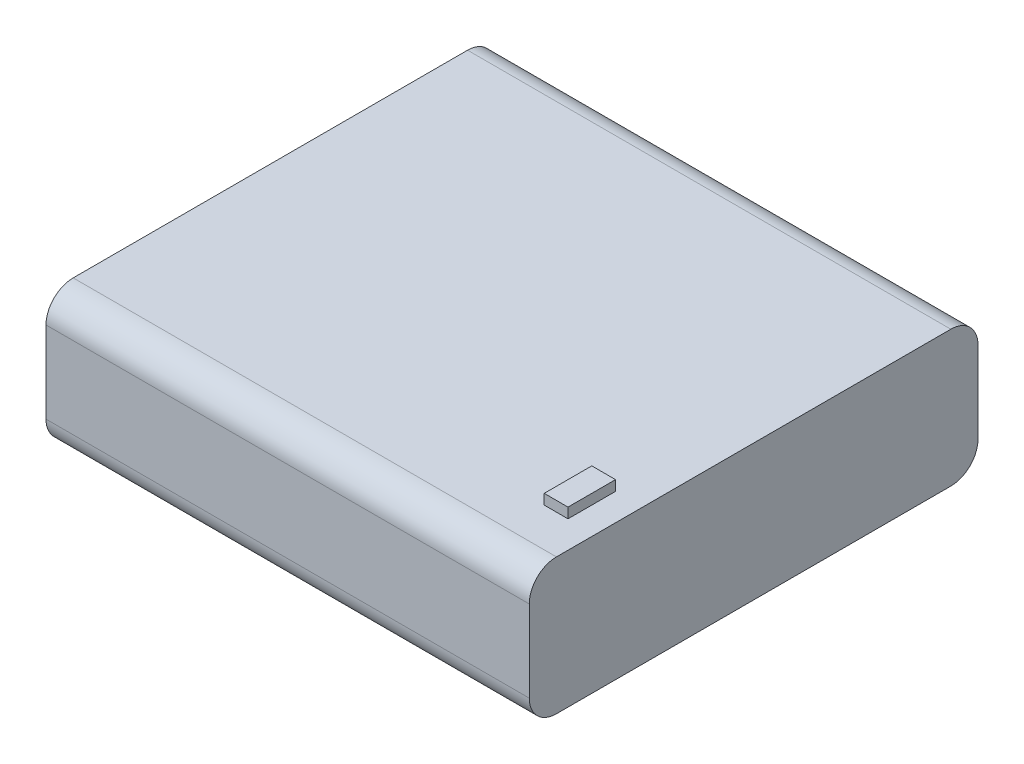
ISO-10303-21;
HEADER;
FILE_DESCRIPTION(('STEP AP214'),'2;1');
FILE_NAME('part.step','',(''),(''),'','','');
FILE_SCHEMA(('AUTOMOTIVE_DESIGN { 1 0 10303 214 1 1 1 1 }'));
ENDSEC;
DATA;
#1=APPLICATION_CONTEXT('core data for automotive mechanical design processes');
#2=APPLICATION_PROTOCOL_DEFINITION('international standard','automotive_design',2000,#1);
#3=PRODUCT_CONTEXT('',#1,'mechanical');
#4=PRODUCT('Part','Part','',(#3));
#5=PRODUCT_RELATED_PRODUCT_CATEGORY('part','',(#4));
#6=PRODUCT_DEFINITION_FORMATION('','',#4);
#7=PRODUCT_DEFINITION_CONTEXT('part definition',#1,'design');
#8=PRODUCT_DEFINITION('design','',#6,#7);
#9=PRODUCT_DEFINITION_SHAPE('','',#8);
#10=(LENGTH_UNIT() NAMED_UNIT(*) SI_UNIT(.MILLI.,.METRE.));
#11=(NAMED_UNIT(*) PLANE_ANGLE_UNIT() SI_UNIT($,.RADIAN.));
#12=(NAMED_UNIT(*) SI_UNIT($,.STERADIAN.) SOLID_ANGLE_UNIT());
#13=UNCERTAINTY_MEASURE_WITH_UNIT(LENGTH_MEASURE(1.E-05),#10,'distance_accuracy_value','');
#14=(GEOMETRIC_REPRESENTATION_CONTEXT(3) GLOBAL_UNCERTAINTY_ASSIGNED_CONTEXT((#13)) GLOBAL_UNIT_ASSIGNED_CONTEXT((#10,
#11,#12)) REPRESENTATION_CONTEXT('',''));
#15=CARTESIAN_POINT('',(0.,0.,0.));
#16=DIRECTION('',(0.,0.,1.));
#17=DIRECTION('',(1.,0.,0.));
#18=AXIS2_PLACEMENT_3D('',#15,#16,#17);
#19=CARTESIAN_POINT('',(35.56,20.,-33.02));
#20=DIRECTION('',(-1.,0.,0.));
#21=DIRECTION('',(0.,0.,1.));
#22=AXIS2_PLACEMENT_3D('',#19,#20,#21);
#23=PLANE('',#22);
#24=DIRECTION('',(0.,0.,-1.));
#25=VECTOR('',#24,1.);
#26=CARTESIAN_POINT('',(35.56,0.,-33.02));
#27=LINE('',#26,#25);
#28=CARTESIAN_POINT('',(35.56,0.,29.02));
#29=VERTEX_POINT('',#28);
#30=CARTESIAN_POINT('',(35.56,0.,-29.02));
#31=VERTEX_POINT('',#30);
#32=EDGE_CURVE('E157',#29,#31,#27,.T.);
#33=ORIENTED_EDGE('',*,*,#32,.T.);
#34=CARTESIAN_POINT('',(35.56,4.,-29.02));
#35=DIRECTION('',(-1.,0.,0.));
#36=DIRECTION('',(0.,0.,1.));
#37=AXIS2_PLACEMENT_3D('',#34,#35,#36);
#38=CIRCLE('',#37,4.);
#39=CARTESIAN_POINT('',(35.56,4.,-33.02));
#40=VERTEX_POINT('',#39);
#41=EDGE_CURVE('E208',#31,#40,#38,.F.);
#42=ORIENTED_EDGE('',*,*,#41,.T.);
#43=DIRECTION('',(0.,-1.,0.));
#44=VECTOR('',#43,1.);
#45=CARTESIAN_POINT('',(35.56,20.,-33.02));
#46=LINE('',#45,#44);
#47=CARTESIAN_POINT('',(35.56,16.,-33.02));
#48=VERTEX_POINT('',#47);
#49=EDGE_CURVE('E182',#48,#40,#46,.T.);
#50=ORIENTED_EDGE('',*,*,#49,.F.);
#51=CARTESIAN_POINT('',(35.56,16.,-29.02));
#52=DIRECTION('',(-1.,0.,0.));
#53=DIRECTION('',(0.,0.,1.));
#54=AXIS2_PLACEMENT_3D('',#51,#52,#53);
#55=CIRCLE('',#54,4.);
#56=CARTESIAN_POINT('',(35.56,20.,-29.02));
#57=VERTEX_POINT('',#56);
#58=EDGE_CURVE('E206',#48,#57,#55,.F.);
#59=ORIENTED_EDGE('',*,*,#58,.T.);
#60=DIRECTION('',(0.,0.,-1.));
#61=VECTOR('',#60,1.);
#62=CARTESIAN_POINT('',(35.56,20.,-33.02));
#63=LINE('',#62,#61);
#64=CARTESIAN_POINT('',(35.56,20.,29.02));
#65=VERTEX_POINT('',#64);
#66=EDGE_CURVE('E162',#65,#57,#63,.T.);
#67=ORIENTED_EDGE('',*,*,#66,.F.);
#68=CARTESIAN_POINT('',(35.56,16.,29.02));
#69=DIRECTION('',(-1.,0.,0.));
#70=DIRECTION('',(0.,0.,1.));
#71=AXIS2_PLACEMENT_3D('',#68,#69,#70);
#72=CIRCLE('',#71,4.);
#73=CARTESIAN_POINT('',(35.56,16.,33.02));
#74=VERTEX_POINT('',#73);
#75=EDGE_CURVE('E202',#65,#74,#72,.F.);
#76=ORIENTED_EDGE('',*,*,#75,.T.);
#77=DIRECTION('',(0.,-1.,0.));
#78=VECTOR('',#77,1.);
#79=CARTESIAN_POINT('',(35.56,20.,33.02));
#80=LINE('',#79,#78);
#81=CARTESIAN_POINT('',(35.56,4.,33.02));
#82=VERTEX_POINT('',#81);
#83=EDGE_CURVE('E169',#74,#82,#80,.T.);
#84=ORIENTED_EDGE('',*,*,#83,.T.);
#85=CARTESIAN_POINT('',(35.56,4.,29.02));
#86=DIRECTION('',(-1.,0.,0.));
#87=DIRECTION('',(0.,0.,1.));
#88=AXIS2_PLACEMENT_3D('',#85,#86,#87);
#89=CIRCLE('',#88,4.);
#90=EDGE_CURVE('E204',#82,#29,#89,.F.);
#91=ORIENTED_EDGE('',*,*,#90,.T.);
#92=EDGE_LOOP('',(#33,#42,#50,#59,#67,#76,#84,#91));
#93=FACE_BOUND('',#92,.T.);
#94=ADVANCED_FACE('F36',(#93),#23,.F.);
#95=CARTESIAN_POINT('',(-35.56,20.,-33.02));
#96=DIRECTION('',(0.,0.,1.));
#97=DIRECTION('',(1.,0.,0.));
#98=AXIS2_PLACEMENT_3D('',#95,#96,#97);
#99=PLANE('',#98);
#100=ORIENTED_EDGE('',*,*,#49,.T.);
#101=DIRECTION('',(-1.,0.,0.));
#102=VECTOR('',#101,1.);
#103=CARTESIAN_POINT('',(-35.56,4.,-33.02));
#104=LINE('',#103,#102);
#105=CARTESIAN_POINT('',(-35.56,4.,-33.02));
#106=VERTEX_POINT('',#105);
#107=EDGE_CURVE('E187',#40,#106,#104,.T.);
#108=ORIENTED_EDGE('',*,*,#107,.T.);
#109=DIRECTION('',(0.,-1.,0.));
#110=VECTOR('',#109,1.);
#111=CARTESIAN_POINT('',(-35.56,20.,-33.02));
#112=LINE('',#111,#110);
#113=CARTESIAN_POINT('',(-35.56,16.,-33.02));
#114=VERTEX_POINT('',#113);
#115=EDGE_CURVE('E179',#114,#106,#112,.T.);
#116=ORIENTED_EDGE('',*,*,#115,.F.);
#117=DIRECTION('',(-1.,0.,0.));
#118=VECTOR('',#117,1.);
#119=CARTESIAN_POINT('',(35.56,16.,-33.02));
#120=LINE('',#119,#118);
#121=EDGE_CURVE('E185',#114,#48,#120,.F.);
#122=ORIENTED_EDGE('',*,*,#121,.T.);
#123=EDGE_LOOP('',(#100,#108,#116,#122));
#124=FACE_BOUND('',#123,.T.);
#125=ADVANCED_FACE('F240',(#124),#99,.F.);
#126=CARTESIAN_POINT('',(-35.56,20.,-33.02));
#127=DIRECTION('',(1.,0.,0.));
#128=DIRECTION('',(0.,0.,-1.));
#129=AXIS2_PLACEMENT_3D('',#126,#127,#128);
#130=PLANE('',#129);
#131=ORIENTED_EDGE('',*,*,#115,.T.);
#132=CARTESIAN_POINT('',(-35.56,4.,-29.02));
#133=DIRECTION('',(1.,0.,0.));
#134=DIRECTION('',(0.,0.,-1.));
#135=AXIS2_PLACEMENT_3D('',#132,#133,#134);
#136=CIRCLE('',#135,4.);
#137=CARTESIAN_POINT('',(-35.56,0.,-29.02));
#138=VERTEX_POINT('',#137);
#139=EDGE_CURVE('E196',#106,#138,#136,.F.);
#140=ORIENTED_EDGE('',*,*,#139,.T.);
#141=DIRECTION('',(0.,0.,1.));
#142=VECTOR('',#141,1.);
#143=CARTESIAN_POINT('',(-35.56,0.,-33.02));
#144=LINE('',#143,#142);
#145=CARTESIAN_POINT('',(-35.56,0.,29.02));
#146=VERTEX_POINT('',#145);
#147=EDGE_CURVE('E166',#138,#146,#144,.T.);
#148=ORIENTED_EDGE('',*,*,#147,.T.);
#149=CARTESIAN_POINT('',(-35.56,4.,29.02));
#150=DIRECTION('',(1.,0.,0.));
#151=DIRECTION('',(0.,0.,-1.));
#152=AXIS2_PLACEMENT_3D('',#149,#150,#151);
#153=CIRCLE('',#152,4.);
#154=CARTESIAN_POINT('',(-35.56,4.,33.02));
#155=VERTEX_POINT('',#154);
#156=EDGE_CURVE('E192',#146,#155,#153,.F.);
#157=ORIENTED_EDGE('',*,*,#156,.T.);
#158=DIRECTION('',(0.,-1.,0.));
#159=VECTOR('',#158,1.);
#160=CARTESIAN_POINT('',(-35.56,20.,33.02));
#161=LINE('',#160,#159);
#162=CARTESIAN_POINT('',(-35.56,16.,33.02));
#163=VERTEX_POINT('',#162);
#164=EDGE_CURVE('E176',#163,#155,#161,.T.);
#165=ORIENTED_EDGE('',*,*,#164,.F.);
#166=CARTESIAN_POINT('',(-35.56,16.,29.02));
#167=DIRECTION('',(1.,0.,0.));
#168=DIRECTION('',(0.,0.,-1.));
#169=AXIS2_PLACEMENT_3D('',#166,#167,#168);
#170=CIRCLE('',#169,4.);
#171=CARTESIAN_POINT('',(-35.56,20.,29.02));
#172=VERTEX_POINT('',#171);
#173=EDGE_CURVE('E190',#163,#172,#170,.F.);
#174=ORIENTED_EDGE('',*,*,#173,.T.);
#175=DIRECTION('',(0.,0.,1.));
#176=VECTOR('',#175,1.);
#177=CARTESIAN_POINT('',(-35.56,20.,-33.02));
#178=LINE('',#177,#176);
#179=CARTESIAN_POINT('',(-35.56,20.,-29.02));
#180=VERTEX_POINT('',#179);
#181=EDGE_CURVE('E165',#180,#172,#178,.T.);
#182=ORIENTED_EDGE('',*,*,#181,.F.);
#183=CARTESIAN_POINT('',(-35.56,16.,-29.02));
#184=DIRECTION('',(1.,0.,0.));
#185=DIRECTION('',(0.,0.,-1.));
#186=AXIS2_PLACEMENT_3D('',#183,#184,#185);
#187=CIRCLE('',#186,4.);
#188=EDGE_CURVE('E194',#180,#114,#187,.F.);
#189=ORIENTED_EDGE('',*,*,#188,.T.);
#190=EDGE_LOOP('',(#131,#140,#148,#157,#165,#174,#182,#189));
#191=FACE_BOUND('',#190,.T.);
#192=ADVANCED_FACE('F224',(#191),#130,.F.);
#193=CARTESIAN_POINT('',(-35.56,20.,33.02));
#194=DIRECTION('',(0.,0.,-1.));
#195=DIRECTION('',(-1.,0.,0.));
#196=AXIS2_PLACEMENT_3D('',#193,#194,#195);
#197=PLANE('',#196);
#198=ORIENTED_EDGE('',*,*,#164,.T.);
#199=DIRECTION('',(1.,0.,0.));
#200=VECTOR('',#199,1.);
#201=CARTESIAN_POINT('',(-35.56,4.,33.02));
#202=LINE('',#201,#200);
#203=EDGE_CURVE('E11',#155,#82,#202,.T.);
#204=ORIENTED_EDGE('',*,*,#203,.T.);
#205=ORIENTED_EDGE('',*,*,#83,.F.);
#206=DIRECTION('',(1.,0.,0.));
#207=VECTOR('',#206,1.);
#208=CARTESIAN_POINT('',(-35.56,16.,33.02));
#209=LINE('',#208,#207);
#210=EDGE_CURVE('E44',#74,#163,#209,.F.);
#211=ORIENTED_EDGE('',*,*,#210,.T.);
#212=EDGE_LOOP('',(#198,#204,#205,#211));
#213=FACE_BOUND('',#212,.T.);
#214=ADVANCED_FACE('F219',(#213),#197,.F.);
#215=CARTESIAN_POINT('',(0.,20.,0.));
#216=DIRECTION('',(0.,1.,0.));
#217=DIRECTION('',(0.,0.,1.));
#218=AXIS2_PLACEMENT_3D('',#215,#216,#217);
#219=PLANE('',#218);
#220=DIRECTION('',(1.,0.,0.));
#221=VECTOR('',#220,1.);
#222=CARTESIAN_POINT('',(28.06,20.,16.32));
#223=LINE('',#222,#221);
#224=CARTESIAN_POINT('',(28.06,20.,16.32));
#225=VERTEX_POINT('',#224);
#226=CARTESIAN_POINT('',(31.56,20.,16.32));
#227=VERTEX_POINT('',#226);
#228=EDGE_CURVE('E152',#225,#227,#223,.T.);
#229=ORIENTED_EDGE('',*,*,#228,.T.);
#230=DIRECTION('',(0.,0.,1.));
#231=VECTOR('',#230,1.);
#232=CARTESIAN_POINT('',(31.56,20.,16.32));
#233=LINE('',#232,#231);
#234=CARTESIAN_POINT('',(31.56,20.,23.32));
#235=VERTEX_POINT('',#234);
#236=EDGE_CURVE('E129',#227,#235,#233,.T.);
#237=ORIENTED_EDGE('',*,*,#236,.T.);
#238=DIRECTION('',(1.,0.,0.));
#239=VECTOR('',#238,1.);
#240=CARTESIAN_POINT('',(28.06,20.,23.32));
#241=LINE('',#240,#239);
#242=CARTESIAN_POINT('',(28.06,20.,23.32));
#243=VERTEX_POINT('',#242);
#244=EDGE_CURVE('E56',#243,#235,#241,.T.);
#245=ORIENTED_EDGE('',*,*,#244,.F.);
#246=DIRECTION('',(0.,0.,1.));
#247=VECTOR('',#246,1.);
#248=CARTESIAN_POINT('',(28.06,20.,16.32));
#249=LINE('',#248,#247);
#250=EDGE_CURVE('E51',#225,#243,#249,.T.);
#251=ORIENTED_EDGE('',*,*,#250,.F.);
#252=EDGE_LOOP('',(#229,#237,#245,#251));
#253=FACE_BOUND('',#252,.T.);
#254=ORIENTED_EDGE('',*,*,#66,.T.);
#255=DIRECTION('',(-1.,0.,0.));
#256=VECTOR('',#255,1.);
#257=CARTESIAN_POINT('',(-35.56,20.,-29.02));
#258=LINE('',#257,#256);
#259=EDGE_CURVE('E213',#57,#180,#258,.T.);
#260=ORIENTED_EDGE('',*,*,#259,.T.);
#261=ORIENTED_EDGE('',*,*,#181,.T.);
#262=DIRECTION('',(1.,0.,0.));
#263=VECTOR('',#262,1.);
#264=CARTESIAN_POINT('',(35.56,20.,29.02));
#265=LINE('',#264,#263);
#266=EDGE_CURVE('E210',#172,#65,#265,.T.);
#267=ORIENTED_EDGE('',*,*,#266,.T.);
#268=EDGE_LOOP('',(#254,#260,#261,#267));
#269=FACE_BOUND('',#268,.T.);
#270=ADVANCED_FACE('F230',(#253,#269),#219,.T.);
#271=CARTESIAN_POINT('',(0.,0.,0.));
#272=DIRECTION('',(0.,1.,0.));
#273=DIRECTION('',(0.,0.,1.));
#274=AXIS2_PLACEMENT_3D('',#271,#272,#273);
#275=PLANE('',#274);
#276=ORIENTED_EDGE('',*,*,#147,.F.);
#277=DIRECTION('',(-1.,0.,0.));
#278=VECTOR('',#277,1.);
#279=CARTESIAN_POINT('',(0.,0.,-29.02));
#280=LINE('',#279,#278);
#281=EDGE_CURVE('E200',#138,#31,#280,.F.);
#282=ORIENTED_EDGE('',*,*,#281,.T.);
#283=ORIENTED_EDGE('',*,*,#32,.F.);
#284=DIRECTION('',(1.,0.,0.));
#285=VECTOR('',#284,1.);
#286=CARTESIAN_POINT('',(0.,0.,29.02));
#287=LINE('',#286,#285);
#288=EDGE_CURVE('E198',#29,#146,#287,.F.);
#289=ORIENTED_EDGE('',*,*,#288,.T.);
#290=EDGE_LOOP('',(#276,#282,#283,#289));
#291=FACE_BOUND('',#290,.T.);
#292=ADVANCED_FACE('F248',(#291),#275,.F.);
#293=CARTESIAN_POINT('',(-35.56,4.,-29.02));
#294=DIRECTION('',(-1.,0.,0.));
#295=DIRECTION('',(0.,0.,1.));
#296=AXIS2_PLACEMENT_3D('',#293,#294,#295);
#297=CYLINDRICAL_SURFACE('',#296,4.);
#298=ORIENTED_EDGE('',*,*,#41,.F.);
#299=ORIENTED_EDGE('',*,*,#281,.F.);
#300=ORIENTED_EDGE('',*,*,#139,.F.);
#301=ORIENTED_EDGE('',*,*,#107,.F.);
#302=EDGE_LOOP('',(#298,#299,#300,#301));
#303=FACE_BOUND('',#302,.T.);
#304=ADVANCED_FACE('F244',(#303),#297,.T.);
#305=CARTESIAN_POINT('',(0.,16.,-29.02));
#306=DIRECTION('',(1.,0.,0.));
#307=DIRECTION('',(0.,0.,-1.));
#308=AXIS2_PLACEMENT_3D('',#305,#306,#307);
#309=CYLINDRICAL_SURFACE('',#308,4.);
#310=ORIENTED_EDGE('',*,*,#58,.F.);
#311=ORIENTED_EDGE('',*,*,#121,.F.);
#312=ORIENTED_EDGE('',*,*,#188,.F.);
#313=ORIENTED_EDGE('',*,*,#259,.F.);
#314=EDGE_LOOP('',(#310,#311,#312,#313));
#315=FACE_BOUND('',#314,.T.);
#316=ADVANCED_FACE('F237',(#315),#309,.T.);
#317=CARTESIAN_POINT('',(-35.56,4.,29.02));
#318=DIRECTION('',(1.,0.,0.));
#319=DIRECTION('',(0.,0.,-1.));
#320=AXIS2_PLACEMENT_3D('',#317,#318,#319);
#321=CYLINDRICAL_SURFACE('',#320,4.);
#322=ORIENTED_EDGE('',*,*,#156,.F.);
#323=ORIENTED_EDGE('',*,*,#288,.F.);
#324=ORIENTED_EDGE('',*,*,#90,.F.);
#325=ORIENTED_EDGE('',*,*,#203,.F.);
#326=EDGE_LOOP('',(#322,#323,#324,#325));
#327=FACE_BOUND('',#326,.T.);
#328=ADVANCED_FACE('F252',(#327),#321,.T.);
#329=CARTESIAN_POINT('',(0.,16.,29.02));
#330=DIRECTION('',(-1.,0.,0.));
#331=DIRECTION('',(0.,0.,1.));
#332=AXIS2_PLACEMENT_3D('',#329,#330,#331);
#333=CYLINDRICAL_SURFACE('',#332,4.);
#334=ORIENTED_EDGE('',*,*,#173,.F.);
#335=ORIENTED_EDGE('',*,*,#210,.F.);
#336=ORIENTED_EDGE('',*,*,#75,.F.);
#337=ORIENTED_EDGE('',*,*,#266,.F.);
#338=EDGE_LOOP('',(#334,#335,#336,#337));
#339=FACE_BOUND('',#338,.T.);
#340=ADVANCED_FACE('F38',(#339),#333,.T.);
#341=CARTESIAN_POINT('',(28.06,21.5,16.32));
#342=DIRECTION('',(0.,0.,-1.));
#343=DIRECTION('',(-1.,0.,0.));
#344=AXIS2_PLACEMENT_3D('',#341,#342,#343);
#345=PLANE('',#344);
#346=ORIENTED_EDGE('',*,*,#228,.F.);
#347=DIRECTION('',(0.,-1.,0.));
#348=VECTOR('',#347,1.);
#349=CARTESIAN_POINT('',(28.06,21.5,16.32));
#350=LINE('',#349,#348);
#351=CARTESIAN_POINT('',(28.06,21.5,16.32));
#352=VERTEX_POINT('',#351);
#353=EDGE_CURVE('E145',#352,#225,#350,.T.);
#354=ORIENTED_EDGE('',*,*,#353,.F.);
#355=DIRECTION('',(1.,0.,0.));
#356=VECTOR('',#355,1.);
#357=CARTESIAN_POINT('',(28.06,21.5,16.32));
#358=LINE('',#357,#356);
#359=CARTESIAN_POINT('',(31.56,21.5,16.32));
#360=VERTEX_POINT('',#359);
#361=EDGE_CURVE('E139',#352,#360,#358,.T.);
#362=ORIENTED_EDGE('',*,*,#361,.T.);
#363=DIRECTION('',(0.,-1.,0.));
#364=VECTOR('',#363,1.);
#365=CARTESIAN_POINT('',(31.56,21.5,16.32));
#366=LINE('',#365,#364);
#367=EDGE_CURVE('E124',#360,#227,#366,.T.);
#368=ORIENTED_EDGE('',*,*,#367,.T.);
#369=EDGE_LOOP('',(#346,#354,#362,#368));
#370=FACE_BOUND('',#369,.T.);
#371=ADVANCED_FACE('F144',(#370),#345,.T.);
#372=CARTESIAN_POINT('',(28.06,21.5,16.32));
#373=DIRECTION('',(1.,0.,0.));
#374=DIRECTION('',(0.,0.,-1.));
#375=AXIS2_PLACEMENT_3D('',#372,#373,#374);
#376=PLANE('',#375);
#377=ORIENTED_EDGE('',*,*,#250,.T.);
#378=DIRECTION('',(0.,-1.,0.));
#379=VECTOR('',#378,1.);
#380=CARTESIAN_POINT('',(28.06,21.5,23.32));
#381=LINE('',#380,#379);
#382=CARTESIAN_POINT('',(28.06,21.5,23.32));
#383=VERTEX_POINT('',#382);
#384=EDGE_CURVE('E158',#383,#243,#381,.T.);
#385=ORIENTED_EDGE('',*,*,#384,.F.);
#386=DIRECTION('',(0.,0.,1.));
#387=VECTOR('',#386,1.);
#388=CARTESIAN_POINT('',(28.06,21.5,16.32));
#389=LINE('',#388,#387);
#390=EDGE_CURVE('E134',#352,#383,#389,.T.);
#391=ORIENTED_EDGE('',*,*,#390,.F.);
#392=ORIENTED_EDGE('',*,*,#353,.T.);
#393=EDGE_LOOP('',(#377,#385,#391,#392));
#394=FACE_BOUND('',#393,.T.);
#395=ADVANCED_FACE('F305',(#394),#376,.F.);
#396=CARTESIAN_POINT('',(28.06,21.5,23.32));
#397=DIRECTION('',(0.,0.,-1.));
#398=DIRECTION('',(-1.,0.,0.));
#399=AXIS2_PLACEMENT_3D('',#396,#397,#398);
#400=PLANE('',#399);
#401=ORIENTED_EDGE('',*,*,#244,.T.);
#402=DIRECTION('',(0.,-1.,0.));
#403=VECTOR('',#402,1.);
#404=CARTESIAN_POINT('',(31.56,21.5,23.32));
#405=LINE('',#404,#403);
#406=CARTESIAN_POINT('',(31.56,21.5,23.32));
#407=VERTEX_POINT('',#406);
#408=EDGE_CURVE('E133',#407,#235,#405,.T.);
#409=ORIENTED_EDGE('',*,*,#408,.F.);
#410=DIRECTION('',(1.,0.,0.));
#411=VECTOR('',#410,1.);
#412=CARTESIAN_POINT('',(28.06,21.5,23.32));
#413=LINE('',#412,#411);
#414=EDGE_CURVE('E141',#383,#407,#413,.T.);
#415=ORIENTED_EDGE('',*,*,#414,.F.);
#416=ORIENTED_EDGE('',*,*,#384,.T.);
#417=EDGE_LOOP('',(#401,#409,#415,#416));
#418=FACE_BOUND('',#417,.T.);
#419=ADVANCED_FACE('F313',(#418),#400,.F.);
#420=CARTESIAN_POINT('',(31.56,21.5,16.32));
#421=DIRECTION('',(1.,0.,0.));
#422=DIRECTION('',(0.,0.,-1.));
#423=AXIS2_PLACEMENT_3D('',#420,#421,#422);
#424=PLANE('',#423);
#425=ORIENTED_EDGE('',*,*,#236,.F.);
#426=ORIENTED_EDGE('',*,*,#367,.F.);
#427=DIRECTION('',(0.,0.,1.));
#428=VECTOR('',#427,1.);
#429=CARTESIAN_POINT('',(31.56,21.5,16.32));
#430=LINE('',#429,#428);
#431=EDGE_CURVE('E128',#360,#407,#430,.T.);
#432=ORIENTED_EDGE('',*,*,#431,.T.);
#433=ORIENTED_EDGE('',*,*,#408,.T.);
#434=EDGE_LOOP('',(#425,#426,#432,#433));
#435=FACE_BOUND('',#434,.T.);
#436=ADVANCED_FACE('F126',(#435),#424,.T.);
#437=CARTESIAN_POINT('',(0.,21.5,0.));
#438=DIRECTION('',(0.,-1.,0.));
#439=DIRECTION('',(0.,0.,-1.));
#440=AXIS2_PLACEMENT_3D('',#437,#438,#439);
#441=PLANE('',#440);
#442=ORIENTED_EDGE('',*,*,#361,.F.);
#443=ORIENTED_EDGE('',*,*,#390,.T.);
#444=ORIENTED_EDGE('',*,*,#414,.T.);
#445=ORIENTED_EDGE('',*,*,#431,.F.);
#446=EDGE_LOOP('',(#442,#443,#444,#445));
#447=FACE_BOUND('',#446,.T.);
#448=ADVANCED_FACE('F138',(#447),#441,.F.);
#449=CLOSED_SHELL('',(#94,#125,#192,#214,#270,#292,#304,#316,#328,#340,#371,#395,#419,#436,#448));
#450=MANIFOLD_SOLID_BREP('B2',#449);
#451=ADVANCED_BREP_SHAPE_REPRESENTATION('',(#18,#450),#14);
#452=SHAPE_DEFINITION_REPRESENTATION(#9,#451);
ENDSEC;
END-ISO-10303-21;
